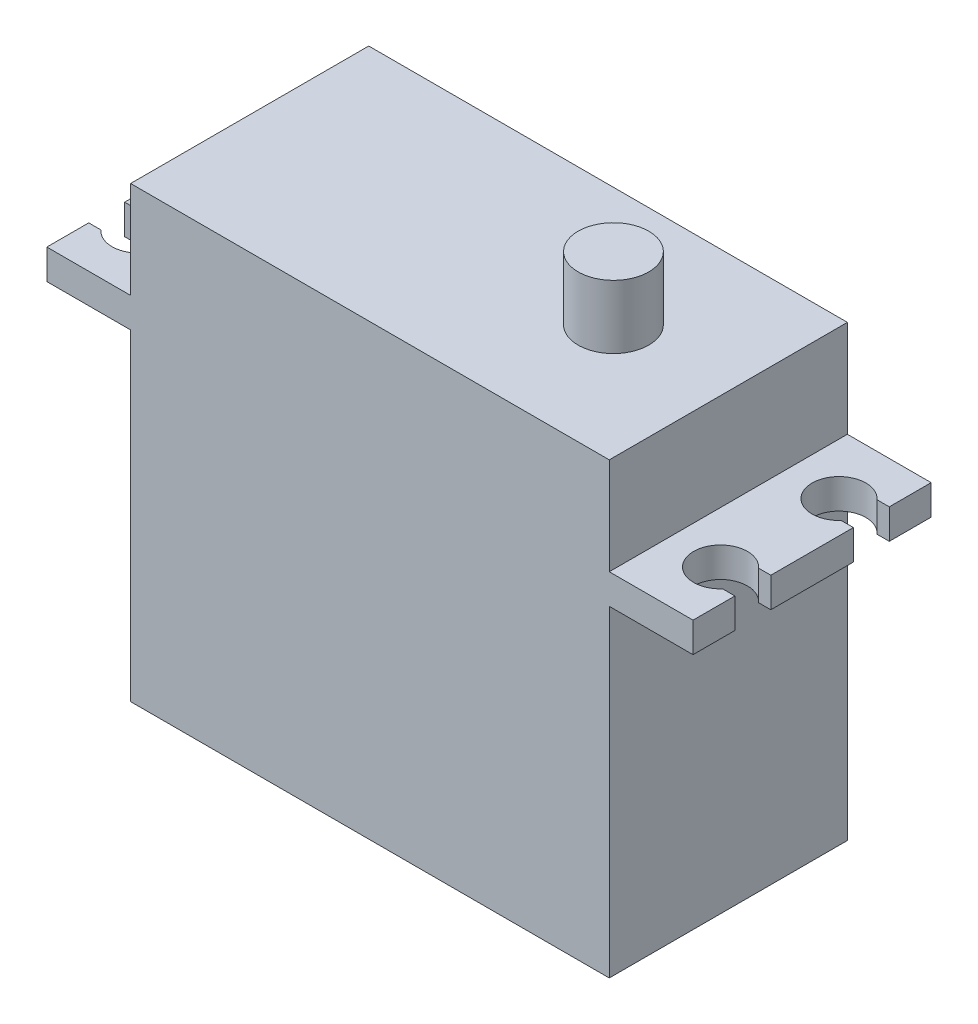
ISO-10303-21;
HEADER;
FILE_DESCRIPTION(('STEP AP214'),'2;1');
FILE_NAME('part.step','',(''),(''),'','','');
FILE_SCHEMA(('AUTOMOTIVE_DESIGN { 1 0 10303 214 1 1 1 1 }'));
ENDSEC;
DATA;
#1=APPLICATION_CONTEXT('core data for automotive mechanical design processes');
#2=APPLICATION_PROTOCOL_DEFINITION('international standard','automotive_design',2000,#1);
#3=PRODUCT_CONTEXT('',#1,'mechanical');
#4=PRODUCT('Part','Part','',(#3));
#5=PRODUCT_RELATED_PRODUCT_CATEGORY('part','',(#4));
#6=PRODUCT_DEFINITION_FORMATION('','',#4);
#7=PRODUCT_DEFINITION_CONTEXT('part definition',#1,'design');
#8=PRODUCT_DEFINITION('design','',#6,#7);
#9=PRODUCT_DEFINITION_SHAPE('','',#8);
#10=(LENGTH_UNIT() NAMED_UNIT(*) SI_UNIT(.MILLI.,.METRE.));
#11=(NAMED_UNIT(*) PLANE_ANGLE_UNIT() SI_UNIT($,.RADIAN.));
#12=(NAMED_UNIT(*) SI_UNIT($,.STERADIAN.) SOLID_ANGLE_UNIT());
#13=UNCERTAINTY_MEASURE_WITH_UNIT(LENGTH_MEASURE(1.E-05),#10,'distance_accuracy_value','');
#14=(GEOMETRIC_REPRESENTATION_CONTEXT(3) GLOBAL_UNCERTAINTY_ASSIGNED_CONTEXT((#13)) GLOBAL_UNIT_ASSIGNED_CONTEXT((#10,
#11,#12)) REPRESENTATION_CONTEXT('',''));
#15=CARTESIAN_POINT('',(0.,0.,0.));
#16=DIRECTION('',(0.,0.,1.));
#17=DIRECTION('',(1.,0.,0.));
#18=AXIS2_PLACEMENT_3D('',#15,#16,#17);
#19=CARTESIAN_POINT('',(10.4,42.8,0.));
#20=DIRECTION('',(0.,-1.,0.));
#21=DIRECTION('',(1.,0.,0.));
#22=AXIS2_PLACEMENT_3D('',#19,#20,#21);
#23=PLANE('',#22);
#24=CARTESIAN_POINT('',(10.4,42.8,0.));
#25=DIRECTION('',(0.,1.,0.));
#26=DIRECTION('',(-1.,0.,0.));
#27=AXIS2_PLACEMENT_3D('',#24,#25,#26);
#28=CIRCLE('',#27,2.95);
#29=CARTESIAN_POINT('',(7.45,42.8,0.));
#30=VERTEX_POINT('',#29);
#31=EDGE_CURVE('E11',#30,#30,#28,.T.);
#32=ORIENTED_EDGE('',*,*,#31,.T.);
#33=EDGE_LOOP('',(#32));
#34=FACE_BOUND('',#33,.T.);
#35=ADVANCED_FACE('F49',(#34),#23,.F.);
#36=CARTESIAN_POINT('',(10.4,42.8,0.));
#37=DIRECTION('',(0.,1.,0.));
#38=DIRECTION('',(-1.,0.,0.));
#39=AXIS2_PLACEMENT_3D('',#36,#37,#38);
#40=CYLINDRICAL_SURFACE('',#39,2.95);
#41=ORIENTED_EDGE('',*,*,#31,.F.);
#42=EDGE_LOOP('',(#41));
#43=FACE_BOUND('',#42,.T.);
#44=CARTESIAN_POINT('',(10.4,25.,0.));
#45=DIRECTION('',(0.,1.,0.));
#46=DIRECTION('',(-1.,0.,0.));
#47=AXIS2_PLACEMENT_3D('',#44,#45,#46);
#48=CIRCLE('',#47,2.95);
#49=CARTESIAN_POINT('',(7.45,25.,0.));
#50=VERTEX_POINT('',#49);
#51=EDGE_CURVE('E55',#50,#50,#48,.T.);
#52=ORIENTED_EDGE('',*,*,#51,.T.);
#53=EDGE_LOOP('',(#52));
#54=FACE_BOUND('',#53,.T.);
#55=ADVANCED_FACE('F81',(#43,#54),#40,.T.);
#56=CARTESIAN_POINT('',(13.35,25.,0.));
#57=DIRECTION('',(0.,-1.,0.));
#58=DIRECTION('',(1.,0.,0.));
#59=AXIS2_PLACEMENT_3D('',#56,#57,#58);
#60=PLANE('',#59);
#61=ORIENTED_EDGE('',*,*,#51,.F.);
#62=EDGE_LOOP('',(#61));
#63=FACE_BOUND('',#62,.T.);
#64=CARTESIAN_POINT('',(10.4,25.,0.));
#65=DIRECTION('',(0.,1.,0.));
#66=DIRECTION('',(-1.,0.,0.));
#67=AXIS2_PLACEMENT_3D('',#64,#65,#66);
#68=CIRCLE('',#67,6.);
#69=CARTESIAN_POINT('',(4.4,25.,0.));
#70=VERTEX_POINT('',#69);
#71=EDGE_CURVE('E59',#70,#70,#68,.T.);
#72=ORIENTED_EDGE('',*,*,#71,.T.);
#73=EDGE_LOOP('',(#72));
#74=FACE_BOUND('',#73,.T.);
#75=ADVANCED_FACE('F77',(#63,#74),#60,.F.);
#76=CARTESIAN_POINT('',(10.4,42.8,0.));
#77=DIRECTION('',(0.,1.,0.));
#78=DIRECTION('',(-1.,0.,0.));
#79=AXIS2_PLACEMENT_3D('',#76,#77,#78);
#80=CYLINDRICAL_SURFACE('',#79,6.);
#81=ORIENTED_EDGE('',*,*,#71,.F.);
#82=EDGE_LOOP('',(#81));
#83=FACE_BOUND('',#82,.T.);
#84=CARTESIAN_POINT('',(10.4,3.,0.));
#85=DIRECTION('',(0.,1.,0.));
#86=DIRECTION('',(-1.,0.,0.));
#87=AXIS2_PLACEMENT_3D('',#84,#85,#86);
#88=CIRCLE('',#87,6.);
#89=CARTESIAN_POINT('',(4.4,3.,0.));
#90=VERTEX_POINT('',#89);
#91=EDGE_CURVE('E63',#90,#90,#88,.T.);
#92=ORIENTED_EDGE('',*,*,#91,.T.);
#93=EDGE_LOOP('',(#92));
#94=FACE_BOUND('',#93,.T.);
#95=ADVANCED_FACE('F69',(#83,#94),#80,.T.);
#96=CARTESIAN_POINT('',(16.4,3.,0.));
#97=DIRECTION('',(0.,1.,0.));
#98=DIRECTION('',(-1.,0.,0.));
#99=AXIS2_PLACEMENT_3D('',#96,#97,#98);
#100=PLANE('',#99);
#101=ORIENTED_EDGE('',*,*,#91,.F.);
#102=EDGE_LOOP('',(#101));
#103=FACE_BOUND('',#102,.T.);
#104=ADVANCED_FACE('F71',(#103),#100,.F.);
#105=CLOSED_SHELL('',(#35,#55,#75,#95,#104));
#106=MANIFOLD_SOLID_BREP('B2',#105);
#107=CARTESIAN_POINT('',(-24.3,29.4,-4.95));
#108=DIRECTION('',(0.,1.,0.));
#109=DIRECTION('',(0.,0.,1.));
#110=AXIS2_PLACEMENT_3D('',#107,#108,#109);
#111=PLANE('',#110);
#112=DIRECTION('',(0.,0.,-1.));
#113=VECTOR('',#112,1.);
#114=CARTESIAN_POINT('',(20.,29.4,9.95));
#115=LINE('',#114,#113);
#116=CARTESIAN_POINT('',(20.,29.4,9.95));
#117=VERTEX_POINT('',#116);
#118=CARTESIAN_POINT('',(20.,29.4,-9.95));
#119=VERTEX_POINT('',#118);
#120=EDGE_CURVE('E135',#117,#119,#115,.T.);
#121=ORIENTED_EDGE('',*,*,#120,.F.);
#122=DIRECTION('',(1.,0.,0.));
#123=VECTOR('',#122,1.);
#124=CARTESIAN_POINT('',(-27.,29.4,9.95));
#125=LINE('',#124,#123);
#126=CARTESIAN_POINT('',(27.,29.4,9.95));
#127=VERTEX_POINT('',#126);
#128=EDGE_CURVE('E360',#117,#127,#125,.T.);
#129=ORIENTED_EDGE('',*,*,#128,.T.);
#130=DIRECTION('',(0.,0.,-1.));
#131=VECTOR('',#130,1.);
#132=CARTESIAN_POINT('',(27.,29.4,9.95));
#133=LINE('',#132,#131);
#134=CARTESIAN_POINT('',(27.,29.4,6.45));
#135=VERTEX_POINT('',#134);
#136=EDGE_CURVE('E363',#127,#135,#133,.T.);
#137=ORIENTED_EDGE('',*,*,#136,.T.);
#138=DIRECTION('',(-1.,0.,0.));
#139=VECTOR('',#138,1.);
#140=CARTESIAN_POINT('',(25.9770509831248,29.4,6.45));
#141=LINE('',#140,#139);
#142=CARTESIAN_POINT('',(25.9770509831248,29.4,6.45));
#143=VERTEX_POINT('',#142);
#144=EDGE_CURVE('E365',#135,#143,#141,.T.);
#145=ORIENTED_EDGE('',*,*,#144,.T.);
#146=CARTESIAN_POINT('',(24.3,29.4,4.95));
#147=DIRECTION('',(0.,-1.,0.));
#148=DIRECTION('',(0.,0.,1.));
#149=AXIS2_PLACEMENT_3D('',#146,#147,#148);
#150=CIRCLE('',#149,2.25);
#151=CARTESIAN_POINT('',(25.9770509831248,29.4,3.45));
#152=VERTEX_POINT('',#151);
#153=EDGE_CURVE('E367',#143,#152,#150,.T.);
#154=ORIENTED_EDGE('',*,*,#153,.T.);
#155=DIRECTION('',(1.,0.,0.));
#156=VECTOR('',#155,1.);
#157=CARTESIAN_POINT('',(25.9770509831248,29.4,3.45));
#158=LINE('',#157,#156);
#159=CARTESIAN_POINT('',(27.,29.4,3.45));
#160=VERTEX_POINT('',#159);
#161=EDGE_CURVE('E369',#152,#160,#158,.T.);
#162=ORIENTED_EDGE('',*,*,#161,.T.);
#163=DIRECTION('',(0.,0.,-1.));
#164=VECTOR('',#163,1.);
#165=CARTESIAN_POINT('',(27.,29.4,3.45));
#166=LINE('',#165,#164);
#167=CARTESIAN_POINT('',(27.,29.4,-3.45));
#168=VERTEX_POINT('',#167);
#169=EDGE_CURVE('E371',#160,#168,#166,.T.);
#170=ORIENTED_EDGE('',*,*,#169,.T.);
#171=DIRECTION('',(-1.,0.,0.));
#172=VECTOR('',#171,1.);
#173=CARTESIAN_POINT('',(25.9770509831248,29.4,-3.45));
#174=LINE('',#173,#172);
#175=CARTESIAN_POINT('',(25.9770509831248,29.4,-3.45));
#176=VERTEX_POINT('',#175);
#177=EDGE_CURVE('E373',#168,#176,#174,.T.);
#178=ORIENTED_EDGE('',*,*,#177,.T.);
#179=CARTESIAN_POINT('',(24.3,29.4,-4.95));
#180=DIRECTION('',(0.,-1.,0.));
#181=DIRECTION('',(0.,0.,1.));
#182=AXIS2_PLACEMENT_3D('',#179,#180,#181);
#183=CIRCLE('',#182,2.25);
#184=CARTESIAN_POINT('',(25.9770509831248,29.4,-6.45));
#185=VERTEX_POINT('',#184);
#186=EDGE_CURVE('E375',#176,#185,#183,.T.);
#187=ORIENTED_EDGE('',*,*,#186,.T.);
#188=DIRECTION('',(1.,0.,0.));
#189=VECTOR('',#188,1.);
#190=CARTESIAN_POINT('',(25.9770509831248,29.4,-6.45));
#191=LINE('',#190,#189);
#192=CARTESIAN_POINT('',(27.,29.4,-6.45));
#193=VERTEX_POINT('',#192);
#194=EDGE_CURVE('E377',#185,#193,#191,.T.);
#195=ORIENTED_EDGE('',*,*,#194,.T.);
#196=DIRECTION('',(0.,0.,-1.));
#197=VECTOR('',#196,1.);
#198=CARTESIAN_POINT('',(27.,29.4,-6.45));
#199=LINE('',#198,#197);
#200=CARTESIAN_POINT('',(27.,29.4,-9.95));
#201=VERTEX_POINT('',#200);
#202=EDGE_CURVE('E335',#193,#201,#199,.T.);
#203=ORIENTED_EDGE('',*,*,#202,.T.);
#204=DIRECTION('',(-1.,0.,0.));
#205=VECTOR('',#204,1.);
#206=CARTESIAN_POINT('',(-27.,29.4,-9.95));
#207=LINE('',#206,#205);
#208=EDGE_CURVE('E340',#201,#119,#207,.T.);
#209=ORIENTED_EDGE('',*,*,#208,.T.);
#210=EDGE_LOOP('',(#121,#129,#137,#145,#154,#162,#170,#178,#187,#195,#203,#209));
#211=FACE_BOUND('',#210,.T.);
#212=ADVANCED_FACE('F119',(#211),#111,.T.);
#213=CARTESIAN_POINT('',(20.,26.9,9.95));
#214=DIRECTION('',(-1.,0.,0.));
#215=DIRECTION('',(0.,0.,1.));
#216=AXIS2_PLACEMENT_3D('',#213,#214,#215);
#217=PLANE('',#216);
#218=DIRECTION('',(0.,0.,-1.));
#219=VECTOR('',#218,1.);
#220=CARTESIAN_POINT('',(20.,0.,9.95));
#221=LINE('',#220,#219);
#222=CARTESIAN_POINT('',(20.,0.,9.95));
#223=VERTEX_POINT('',#222);
#224=CARTESIAN_POINT('',(20.,0.,-9.95));
#225=VERTEX_POINT('',#224);
#226=EDGE_CURVE('E479',#223,#225,#221,.T.);
#227=ORIENTED_EDGE('',*,*,#226,.T.);
#228=DIRECTION('',(0.,-1.,0.));
#229=VECTOR('',#228,1.);
#230=CARTESIAN_POINT('',(20.,26.9,-9.95));
#231=LINE('',#230,#229);
#232=CARTESIAN_POINT('',(20.,26.9,-9.95));
#233=VERTEX_POINT('',#232);
#234=EDGE_CURVE('E47',#233,#225,#231,.T.);
#235=ORIENTED_EDGE('',*,*,#234,.F.);
#236=DIRECTION('',(0.,0.,-1.));
#237=VECTOR('',#236,1.);
#238=CARTESIAN_POINT('',(20.,26.9,9.95));
#239=LINE('',#238,#237);
#240=CARTESIAN_POINT('',(20.,26.9,9.95));
#241=VERTEX_POINT('',#240);
#242=EDGE_CURVE('E480',#241,#233,#239,.T.);
#243=ORIENTED_EDGE('',*,*,#242,.F.);
#244=DIRECTION('',(0.,-1.,0.));
#245=VECTOR('',#244,1.);
#246=CARTESIAN_POINT('',(20.,26.9,9.95));
#247=LINE('',#246,#245);
#248=EDGE_CURVE('E487',#241,#223,#247,.T.);
#249=ORIENTED_EDGE('',*,*,#248,.T.);
#250=EDGE_LOOP('',(#227,#235,#243,#249));
#251=FACE_BOUND('',#250,.T.);
#252=ADVANCED_FACE('F121',(#251),#217,.F.);
#253=CARTESIAN_POINT('',(-20.,26.9,-9.95));
#254=DIRECTION('',(0.,0.,1.));
#255=DIRECTION('',(1.,0.,0.));
#256=AXIS2_PLACEMENT_3D('',#253,#254,#255);
#257=PLANE('',#256);
#258=DIRECTION('',(-1.,0.,0.));
#259=VECTOR('',#258,1.);
#260=CARTESIAN_POINT('',(-20.,0.,-9.95));
#261=LINE('',#260,#259);
#262=CARTESIAN_POINT('',(-20.,0.,-9.95));
#263=VERTEX_POINT('',#262);
#264=EDGE_CURVE('E490',#225,#263,#261,.T.);
#265=ORIENTED_EDGE('',*,*,#264,.T.);
#266=DIRECTION('',(0.,-1.,0.));
#267=VECTOR('',#266,1.);
#268=CARTESIAN_POINT('',(-20.,26.9,-9.95));
#269=LINE('',#268,#267);
#270=CARTESIAN_POINT('',(-20.,26.9,-9.95));
#271=VERTEX_POINT('',#270);
#272=EDGE_CURVE('E128',#271,#263,#269,.T.);
#273=ORIENTED_EDGE('',*,*,#272,.F.);
#274=DIRECTION('',(-1.,0.,0.));
#275=VECTOR('',#274,1.);
#276=CARTESIAN_POINT('',(-27.,26.9,-9.95));
#277=LINE('',#276,#275);
#278=CARTESIAN_POINT('',(-27.,26.9,-9.95));
#279=VERTEX_POINT('',#278);
#280=EDGE_CURVE('E329',#271,#279,#277,.T.);
#281=ORIENTED_EDGE('',*,*,#280,.T.);
#282=DIRECTION('',(0.,-1.,0.));
#283=VECTOR('',#282,1.);
#284=CARTESIAN_POINT('',(-27.,29.4,-9.95));
#285=LINE('',#284,#283);
#286=CARTESIAN_POINT('',(-27.,29.4,-9.95));
#287=VERTEX_POINT('',#286);
#288=EDGE_CURVE('E473',#287,#279,#285,.T.);
#289=ORIENTED_EDGE('',*,*,#288,.F.);
#290=CARTESIAN_POINT('',(-20.,29.4,-9.95));
#291=VERTEX_POINT('',#290);
#292=EDGE_CURVE('E338',#291,#287,#207,.T.);
#293=ORIENTED_EDGE('',*,*,#292,.F.);
#294=DIRECTION('',(0.,-1.,0.));
#295=VECTOR('',#294,1.);
#296=CARTESIAN_POINT('',(-20.,37.5,-9.95));
#297=LINE('',#296,#295);
#298=CARTESIAN_POINT('',(-20.,37.5,-9.95));
#299=VERTEX_POINT('',#298);
#300=EDGE_CURVE('E311',#299,#291,#297,.T.);
#301=ORIENTED_EDGE('',*,*,#300,.F.);
#302=DIRECTION('',(-1.,0.,0.));
#303=VECTOR('',#302,1.);
#304=CARTESIAN_POINT('',(-20.,37.5,-9.95));
#305=LINE('',#304,#303);
#306=CARTESIAN_POINT('',(20.,37.5,-9.95));
#307=VERTEX_POINT('',#306);
#308=EDGE_CURVE('E305',#307,#299,#305,.T.);
#309=ORIENTED_EDGE('',*,*,#308,.F.);
#310=DIRECTION('',(0.,-1.,0.));
#311=VECTOR('',#310,1.);
#312=CARTESIAN_POINT('',(20.,37.5,-9.95));
#313=LINE('',#312,#311);
#314=EDGE_CURVE('E309',#307,#119,#313,.T.);
#315=ORIENTED_EDGE('',*,*,#314,.T.);
#316=ORIENTED_EDGE('',*,*,#208,.F.);
#317=DIRECTION('',(0.,-1.,0.));
#318=VECTOR('',#317,1.);
#319=CARTESIAN_POINT('',(27.,29.4,-9.95));
#320=LINE('',#319,#318);
#321=CARTESIAN_POINT('',(27.,26.9,-9.95));
#322=VERTEX_POINT('',#321);
#323=EDGE_CURVE('E476',#201,#322,#320,.T.);
#324=ORIENTED_EDGE('',*,*,#323,.T.);
#325=EDGE_CURVE('E380',#322,#233,#277,.T.);
#326=ORIENTED_EDGE('',*,*,#325,.T.);
#327=ORIENTED_EDGE('',*,*,#234,.T.);
#328=EDGE_LOOP('',(#265,#273,#281,#289,#293,#301,#309,#315,#316,#324,#326,#327));
#329=FACE_BOUND('',#328,.T.);
#330=ADVANCED_FACE('F307',(#329),#257,.F.);
#331=CARTESIAN_POINT('',(-20.,26.9,9.95));
#332=DIRECTION('',(1.,0.,0.));
#333=DIRECTION('',(0.,0.,-1.));
#334=AXIS2_PLACEMENT_3D('',#331,#332,#333);
#335=PLANE('',#334);
#336=DIRECTION('',(0.,0.,1.));
#337=VECTOR('',#336,1.);
#338=CARTESIAN_POINT('',(-20.,0.,9.95));
#339=LINE('',#338,#337);
#340=CARTESIAN_POINT('',(-20.,0.,9.95));
#341=VERTEX_POINT('',#340);
#342=EDGE_CURVE('E492',#263,#341,#339,.T.);
#343=ORIENTED_EDGE('',*,*,#342,.T.);
#344=DIRECTION('',(0.,-1.,0.));
#345=VECTOR('',#344,1.);
#346=CARTESIAN_POINT('',(-20.,26.9,9.95));
#347=LINE('',#346,#345);
#348=CARTESIAN_POINT('',(-20.,26.9,9.95));
#349=VERTEX_POINT('',#348);
#350=EDGE_CURVE('E497',#349,#341,#347,.T.);
#351=ORIENTED_EDGE('',*,*,#350,.F.);
#352=DIRECTION('',(0.,0.,1.));
#353=VECTOR('',#352,1.);
#354=CARTESIAN_POINT('',(-20.,26.9,9.95));
#355=LINE('',#354,#353);
#356=EDGE_CURVE('E483',#271,#349,#355,.T.);
#357=ORIENTED_EDGE('',*,*,#356,.F.);
#358=ORIENTED_EDGE('',*,*,#272,.T.);
#359=EDGE_LOOP('',(#343,#351,#357,#358));
#360=FACE_BOUND('',#359,.T.);
#361=ADVANCED_FACE('F504',(#360),#335,.F.);
#362=CARTESIAN_POINT('',(-20.,26.9,9.95));
#363=DIRECTION('',(0.,0.,-1.));
#364=DIRECTION('',(-1.,0.,0.));
#365=AXIS2_PLACEMENT_3D('',#362,#363,#364);
#366=PLANE('',#365);
#367=DIRECTION('',(1.,0.,0.));
#368=VECTOR('',#367,1.);
#369=CARTESIAN_POINT('',(-20.,0.,9.95));
#370=LINE('',#369,#368);
#371=EDGE_CURVE('E484',#341,#223,#370,.T.);
#372=ORIENTED_EDGE('',*,*,#371,.T.);
#373=ORIENTED_EDGE('',*,*,#248,.F.);
#374=DIRECTION('',(1.,0.,0.));
#375=VECTOR('',#374,1.);
#376=CARTESIAN_POINT('',(-27.,26.9,9.95));
#377=LINE('',#376,#375);
#378=CARTESIAN_POINT('',(27.,26.9,9.95));
#379=VERTEX_POINT('',#378);
#380=EDGE_CURVE('E401',#241,#379,#377,.T.);
#381=ORIENTED_EDGE('',*,*,#380,.T.);
#382=DIRECTION('',(0.,-1.,0.));
#383=VECTOR('',#382,1.);
#384=CARTESIAN_POINT('',(27.,29.4,9.95));
#385=LINE('',#384,#383);
#386=EDGE_CURVE('E443',#127,#379,#385,.T.);
#387=ORIENTED_EDGE('',*,*,#386,.F.);
#388=ORIENTED_EDGE('',*,*,#128,.F.);
#389=DIRECTION('',(0.,-1.,0.));
#390=VECTOR('',#389,1.);
#391=CARTESIAN_POINT('',(20.,37.5,9.95));
#392=LINE('',#391,#390);
#393=CARTESIAN_POINT('',(20.,37.5,9.95));
#394=VERTEX_POINT('',#393);
#395=EDGE_CURVE('E526',#394,#117,#392,.T.);
#396=ORIENTED_EDGE('',*,*,#395,.F.);
#397=DIRECTION('',(1.,0.,0.));
#398=VECTOR('',#397,1.);
#399=CARTESIAN_POINT('',(-20.,37.5,9.95));
#400=LINE('',#399,#398);
#401=CARTESIAN_POINT('',(-20.,37.5,9.95));
#402=VERTEX_POINT('',#401);
#403=EDGE_CURVE('E320',#402,#394,#400,.T.);
#404=ORIENTED_EDGE('',*,*,#403,.F.);
#405=DIRECTION('',(0.,-1.,0.));
#406=VECTOR('',#405,1.);
#407=CARTESIAN_POINT('',(-20.,37.5,9.95));
#408=LINE('',#407,#406);
#409=CARTESIAN_POINT('',(-20.,29.4,9.95));
#410=VERTEX_POINT('',#409);
#411=EDGE_CURVE('E331',#402,#410,#408,.T.);
#412=ORIENTED_EDGE('',*,*,#411,.T.);
#413=CARTESIAN_POINT('',(-27.,29.4,9.95));
#414=VERTEX_POINT('',#413);
#415=EDGE_CURVE('E361',#414,#410,#125,.T.);
#416=ORIENTED_EDGE('',*,*,#415,.F.);
#417=DIRECTION('',(0.,-1.,0.));
#418=VECTOR('',#417,1.);
#419=CARTESIAN_POINT('',(-27.,29.4,9.95));
#420=LINE('',#419,#418);
#421=CARTESIAN_POINT('',(-27.,26.9,9.95));
#422=VERTEX_POINT('',#421);
#423=EDGE_CURVE('E446',#414,#422,#420,.T.);
#424=ORIENTED_EDGE('',*,*,#423,.T.);
#425=EDGE_CURVE('E402',#422,#349,#377,.T.);
#426=ORIENTED_EDGE('',*,*,#425,.T.);
#427=ORIENTED_EDGE('',*,*,#350,.T.);
#428=EDGE_LOOP('',(#372,#373,#381,#387,#388,#396,#404,#412,#416,#424,#426,#427));
#429=FACE_BOUND('',#428,.T.);
#430=ADVANCED_FACE('F511',(#429),#366,.F.);
#431=CARTESIAN_POINT('',(0.,0.,0.));
#432=DIRECTION('',(0.,-1.,0.));
#433=DIRECTION('',(0.,0.,-1.));
#434=AXIS2_PLACEMENT_3D('',#431,#432,#433);
#435=PLANE('',#434);
#436=ORIENTED_EDGE('',*,*,#226,.F.);
#437=ORIENTED_EDGE('',*,*,#371,.F.);
#438=ORIENTED_EDGE('',*,*,#342,.F.);
#439=ORIENTED_EDGE('',*,*,#264,.F.);
#440=EDGE_LOOP('',(#436,#437,#438,#439));
#441=FACE_BOUND('',#440,.T.);
#442=ADVANCED_FACE('F509',(#441),#435,.T.);
#443=CARTESIAN_POINT('',(-24.3,26.9,-4.95));
#444=DIRECTION('',(0.,1.,0.));
#445=DIRECTION('',(0.,0.,1.));
#446=AXIS2_PLACEMENT_3D('',#443,#444,#445);
#447=PLANE('',#446);
#448=ORIENTED_EDGE('',*,*,#380,.F.);
#449=ORIENTED_EDGE('',*,*,#242,.T.);
#450=ORIENTED_EDGE('',*,*,#325,.F.);
#451=DIRECTION('',(0.,0.,-1.));
#452=VECTOR('',#451,1.);
#453=CARTESIAN_POINT('',(27.,26.9,-6.45));
#454=LINE('',#453,#452);
#455=CARTESIAN_POINT('',(27.,26.9,-6.45));
#456=VERTEX_POINT('',#455);
#457=EDGE_CURVE('E326',#456,#322,#454,.T.);
#458=ORIENTED_EDGE('',*,*,#457,.F.);
#459=DIRECTION('',(1.,0.,0.));
#460=VECTOR('',#459,1.);
#461=CARTESIAN_POINT('',(25.9770509831248,26.9,-6.45));
#462=LINE('',#461,#460);
#463=CARTESIAN_POINT('',(25.9770509831248,26.9,-6.45));
#464=VERTEX_POINT('',#463);
#465=EDGE_CURVE('E339',#464,#456,#462,.T.);
#466=ORIENTED_EDGE('',*,*,#465,.F.);
#467=CARTESIAN_POINT('',(24.3,26.9,-4.95));
#468=DIRECTION('',(0.,-1.,0.));
#469=DIRECTION('',(0.,0.,1.));
#470=AXIS2_PLACEMENT_3D('',#467,#468,#469);
#471=CIRCLE('',#470,2.25);
#472=CARTESIAN_POINT('',(25.9770509831248,26.9,-3.45));
#473=VERTEX_POINT('',#472);
#474=EDGE_CURVE('E417',#473,#464,#471,.T.);
#475=ORIENTED_EDGE('',*,*,#474,.F.);
#476=DIRECTION('',(-1.,0.,0.));
#477=VECTOR('',#476,1.);
#478=CARTESIAN_POINT('',(25.9770509831248,26.9,-3.45));
#479=LINE('',#478,#477);
#480=CARTESIAN_POINT('',(27.,26.9,-3.45));
#481=VERTEX_POINT('',#480);
#482=EDGE_CURVE('E415',#481,#473,#479,.T.);
#483=ORIENTED_EDGE('',*,*,#482,.F.);
#484=DIRECTION('',(0.,0.,-1.));
#485=VECTOR('',#484,1.);
#486=CARTESIAN_POINT('',(27.,26.9,3.45));
#487=LINE('',#486,#485);
#488=CARTESIAN_POINT('',(27.,26.9,3.45));
#489=VERTEX_POINT('',#488);
#490=EDGE_CURVE('E413',#489,#481,#487,.T.);
#491=ORIENTED_EDGE('',*,*,#490,.F.);
#492=DIRECTION('',(1.,0.,0.));
#493=VECTOR('',#492,1.);
#494=CARTESIAN_POINT('',(25.9770509831248,26.9,3.45));
#495=LINE('',#494,#493);
#496=CARTESIAN_POINT('',(25.9770509831248,26.9,3.45));
#497=VERTEX_POINT('',#496);
#498=EDGE_CURVE('E411',#497,#489,#495,.T.);
#499=ORIENTED_EDGE('',*,*,#498,.F.);
#500=CARTESIAN_POINT('',(24.3,26.9,4.95));
#501=DIRECTION('',(0.,-1.,0.));
#502=DIRECTION('',(0.,0.,1.));
#503=AXIS2_PLACEMENT_3D('',#500,#501,#502);
#504=CIRCLE('',#503,2.25);
#505=CARTESIAN_POINT('',(25.9770509831248,26.9,6.45));
#506=VERTEX_POINT('',#505);
#507=EDGE_CURVE('E409',#506,#497,#504,.T.);
#508=ORIENTED_EDGE('',*,*,#507,.F.);
#509=DIRECTION('',(-1.,0.,0.));
#510=VECTOR('',#509,1.);
#511=CARTESIAN_POINT('',(25.9770509831248,26.9,6.45));
#512=LINE('',#511,#510);
#513=CARTESIAN_POINT('',(27.,26.9,6.45));
#514=VERTEX_POINT('',#513);
#515=EDGE_CURVE('E407',#514,#506,#512,.T.);
#516=ORIENTED_EDGE('',*,*,#515,.F.);
#517=DIRECTION('',(0.,0.,-1.));
#518=VECTOR('',#517,1.);
#519=CARTESIAN_POINT('',(27.,26.9,9.95));
#520=LINE('',#519,#518);
#521=EDGE_CURVE('E405',#379,#514,#520,.T.);
#522=ORIENTED_EDGE('',*,*,#521,.F.);
#523=EDGE_LOOP('',(#448,#449,#450,#458,#466,#475,#483,#491,#499,#508,#516,#522));
#524=FACE_BOUND('',#523,.T.);
#525=ADVANCED_FACE('F517',(#524),#447,.F.);
#526=ORIENTED_EDGE('',*,*,#280,.F.);
#527=ORIENTED_EDGE('',*,*,#356,.T.);
#528=ORIENTED_EDGE('',*,*,#425,.F.);
#529=DIRECTION('',(0.,0.,1.));
#530=VECTOR('',#529,1.);
#531=CARTESIAN_POINT('',(-27.,26.9,9.95));
#532=LINE('',#531,#530);
#533=CARTESIAN_POINT('',(-27.,26.9,6.45));
#534=VERTEX_POINT('',#533);
#535=EDGE_CURVE('E399',#534,#422,#532,.T.);
#536=ORIENTED_EDGE('',*,*,#535,.F.);
#537=DIRECTION('',(-1.,0.,0.));
#538=VECTOR('',#537,1.);
#539=CARTESIAN_POINT('',(-25.9770509831249,26.9,6.45));
#540=LINE('',#539,#538);
#541=CARTESIAN_POINT('',(-25.9770509831249,26.9,6.45));
#542=VERTEX_POINT('',#541);
#543=EDGE_CURVE('E397',#542,#534,#540,.T.);
#544=ORIENTED_EDGE('',*,*,#543,.F.);
#545=CARTESIAN_POINT('',(-24.3,26.9,4.95));
#546=DIRECTION('',(0.,-1.,0.));
#547=DIRECTION('',(0.,0.,1.));
#548=AXIS2_PLACEMENT_3D('',#545,#546,#547);
#549=CIRCLE('',#548,2.25);
#550=CARTESIAN_POINT('',(-25.9770509831249,26.9,3.45));
#551=VERTEX_POINT('',#550);
#552=EDGE_CURVE('E395',#551,#542,#549,.T.);
#553=ORIENTED_EDGE('',*,*,#552,.F.);
#554=DIRECTION('',(1.,0.,0.));
#555=VECTOR('',#554,1.);
#556=CARTESIAN_POINT('',(-25.9770509831249,26.9,3.45));
#557=LINE('',#556,#555);
#558=CARTESIAN_POINT('',(-27.,26.9,3.45));
#559=VERTEX_POINT('',#558);
#560=EDGE_CURVE('E393',#559,#551,#557,.T.);
#561=ORIENTED_EDGE('',*,*,#560,.F.);
#562=DIRECTION('',(0.,0.,1.));
#563=VECTOR('',#562,1.);
#564=CARTESIAN_POINT('',(-27.,26.9,3.45));
#565=LINE('',#564,#563);
#566=CARTESIAN_POINT('',(-27.,26.9,-3.45000000000001));
#567=VERTEX_POINT('',#566);
#568=EDGE_CURVE('E391',#567,#559,#565,.T.);
#569=ORIENTED_EDGE('',*,*,#568,.F.);
#570=DIRECTION('',(-1.,0.,0.));
#571=VECTOR('',#570,1.);
#572=CARTESIAN_POINT('',(-25.9770509831249,26.9,-3.45000000000001));
#573=LINE('',#572,#571);
#574=CARTESIAN_POINT('',(-25.9770509831249,26.9,-3.45000000000001));
#575=VERTEX_POINT('',#574);
#576=EDGE_CURVE('E389',#575,#567,#573,.T.);
#577=ORIENTED_EDGE('',*,*,#576,.F.);
#578=CARTESIAN_POINT('',(-24.3,26.9,-4.95));
#579=DIRECTION('',(0.,-1.,0.));
#580=DIRECTION('',(0.,0.,1.));
#581=AXIS2_PLACEMENT_3D('',#578,#579,#580);
#582=CIRCLE('',#581,2.25);
#583=CARTESIAN_POINT('',(-25.9770509831249,26.9,-6.45));
#584=VERTEX_POINT('',#583);
#585=EDGE_CURVE('E387',#584,#575,#582,.T.);
#586=ORIENTED_EDGE('',*,*,#585,.F.);
#587=DIRECTION('',(1.,0.,0.));
#588=VECTOR('',#587,1.);
#589=CARTESIAN_POINT('',(-25.9770509831249,26.9,-6.45));
#590=LINE('',#589,#588);
#591=CARTESIAN_POINT('',(-27.,26.9,-6.45));
#592=VERTEX_POINT('',#591);
#593=EDGE_CURVE('E385',#592,#584,#590,.T.);
#594=ORIENTED_EDGE('',*,*,#593,.F.);
#595=DIRECTION('',(0.,0.,1.));
#596=VECTOR('',#595,1.);
#597=CARTESIAN_POINT('',(-27.,26.9,-6.45));
#598=LINE('',#597,#596);
#599=EDGE_CURVE('E383',#279,#592,#598,.T.);
#600=ORIENTED_EDGE('',*,*,#599,.F.);
#601=EDGE_LOOP('',(#526,#527,#528,#536,#544,#553,#561,#569,#577,#586,#594,#600));
#602=FACE_BOUND('',#601,.T.);
#603=ADVANCED_FACE('F644',(#602),#447,.F.);
#604=CARTESIAN_POINT('',(27.,29.4,-6.45));
#605=DIRECTION('',(-1.,0.,0.));
#606=DIRECTION('',(0.,0.,1.));
#607=AXIS2_PLACEMENT_3D('',#604,#605,#606);
#608=PLANE('',#607);
#609=ORIENTED_EDGE('',*,*,#457,.T.);
#610=ORIENTED_EDGE('',*,*,#323,.F.);
#611=ORIENTED_EDGE('',*,*,#202,.F.);
#612=DIRECTION('',(0.,-1.,0.));
#613=VECTOR('',#612,1.);
#614=CARTESIAN_POINT('',(27.,29.4,-6.45));
#615=LINE('',#614,#613);
#616=EDGE_CURVE('E378',#193,#456,#615,.T.);
#617=ORIENTED_EDGE('',*,*,#616,.T.);
#618=EDGE_LOOP('',(#609,#610,#611,#617));
#619=FACE_BOUND('',#618,.T.);
#620=ADVANCED_FACE('F640',(#619),#608,.F.);
#621=CARTESIAN_POINT('',(-27.,29.4,-6.45));
#622=DIRECTION('',(1.,0.,0.));
#623=DIRECTION('',(0.,0.,-1.));
#624=AXIS2_PLACEMENT_3D('',#621,#622,#623);
#625=PLANE('',#624);
#626=ORIENTED_EDGE('',*,*,#599,.T.);
#627=DIRECTION('',(0.,-1.,0.));
#628=VECTOR('',#627,1.);
#629=CARTESIAN_POINT('',(-27.,29.4,-6.45));
#630=LINE('',#629,#628);
#631=CARTESIAN_POINT('',(-27.,29.4,-6.45));
#632=VERTEX_POINT('',#631);
#633=EDGE_CURVE('E470',#632,#592,#630,.T.);
#634=ORIENTED_EDGE('',*,*,#633,.F.);
#635=DIRECTION('',(0.,0.,1.));
#636=VECTOR('',#635,1.);
#637=CARTESIAN_POINT('',(-27.,29.4,-6.45));
#638=LINE('',#637,#636);
#639=EDGE_CURVE('E342',#287,#632,#638,.T.);
#640=ORIENTED_EDGE('',*,*,#639,.F.);
#641=ORIENTED_EDGE('',*,*,#288,.T.);
#642=EDGE_LOOP('',(#626,#634,#640,#641));
#643=FACE_BOUND('',#642,.T.);
#644=ADVANCED_FACE('F636',(#643),#625,.F.);
#645=CARTESIAN_POINT('',(-25.9770509831249,29.4,-6.45));
#646=DIRECTION('',(0.,0.,-1.));
#647=DIRECTION('',(-1.,0.,0.));
#648=AXIS2_PLACEMENT_3D('',#645,#646,#647);
#649=PLANE('',#648);
#650=ORIENTED_EDGE('',*,*,#593,.T.);
#651=DIRECTION('',(0.,-1.,0.));
#652=VECTOR('',#651,1.);
#653=CARTESIAN_POINT('',(-25.9770509831249,29.4,-6.45));
#654=LINE('',#653,#652);
#655=CARTESIAN_POINT('',(-25.9770509831249,29.4,-6.45));
#656=VERTEX_POINT('',#655);
#657=EDGE_CURVE('E467',#656,#584,#654,.T.);
#658=ORIENTED_EDGE('',*,*,#657,.F.);
#659=DIRECTION('',(1.,0.,0.));
#660=VECTOR('',#659,1.);
#661=CARTESIAN_POINT('',(-25.9770509831249,29.4,-6.45));
#662=LINE('',#661,#660);
#663=EDGE_CURVE('E344',#632,#656,#662,.T.);
#664=ORIENTED_EDGE('',*,*,#663,.F.);
#665=ORIENTED_EDGE('',*,*,#633,.T.);
#666=EDGE_LOOP('',(#650,#658,#664,#665));
#667=FACE_BOUND('',#666,.T.);
#668=ADVANCED_FACE('F632',(#667),#649,.F.);
#669=CARTESIAN_POINT('',(-24.3,29.4,-4.95));
#670=DIRECTION('',(0.,-1.,0.));
#671=DIRECTION('',(0.,0.,-1.));
#672=AXIS2_PLACEMENT_3D('',#669,#670,#671);
#673=CYLINDRICAL_SURFACE('',#672,2.25);
#674=ORIENTED_EDGE('',*,*,#585,.T.);
#675=DIRECTION('',(0.,-1.,0.));
#676=VECTOR('',#675,1.);
#677=CARTESIAN_POINT('',(-25.9770509831249,29.4,-3.45000000000001));
#678=LINE('',#677,#676);
#679=CARTESIAN_POINT('',(-25.9770509831249,29.4,-3.45000000000001));
#680=VERTEX_POINT('',#679);
#681=EDGE_CURVE('E464',#680,#575,#678,.T.);
#682=ORIENTED_EDGE('',*,*,#681,.F.);
#683=CARTESIAN_POINT('',(-24.3,29.4,-4.95));
#684=DIRECTION('',(0.,-1.,0.));
#685=DIRECTION('',(0.,0.,1.));
#686=AXIS2_PLACEMENT_3D('',#683,#684,#685);
#687=CIRCLE('',#686,2.25);
#688=EDGE_CURVE('E346',#656,#680,#687,.T.);
#689=ORIENTED_EDGE('',*,*,#688,.F.);
#690=ORIENTED_EDGE('',*,*,#657,.T.);
#691=EDGE_LOOP('',(#674,#682,#689,#690));
#692=FACE_BOUND('',#691,.T.);
#693=ADVANCED_FACE('F628',(#692),#673,.F.);
#694=CARTESIAN_POINT('',(-25.9770509831249,29.4,-3.45000000000001));
#695=DIRECTION('',(0.,0.,1.));
#696=DIRECTION('',(1.,0.,0.));
#697=AXIS2_PLACEMENT_3D('',#694,#695,#696);
#698=PLANE('',#697);
#699=ORIENTED_EDGE('',*,*,#576,.T.);
#700=DIRECTION('',(0.,-1.,0.));
#701=VECTOR('',#700,1.);
#702=CARTESIAN_POINT('',(-27.,29.4,-3.45000000000001));
#703=LINE('',#702,#701);
#704=CARTESIAN_POINT('',(-27.,29.4,-3.45000000000001));
#705=VERTEX_POINT('',#704);
#706=EDGE_CURVE('E461',#705,#567,#703,.T.);
#707=ORIENTED_EDGE('',*,*,#706,.F.);
#708=DIRECTION('',(-1.,0.,0.));
#709=VECTOR('',#708,1.);
#710=CARTESIAN_POINT('',(-25.9770509831249,29.4,-3.45000000000001));
#711=LINE('',#710,#709);
#712=EDGE_CURVE('E348',#680,#705,#711,.T.);
#713=ORIENTED_EDGE('',*,*,#712,.F.);
#714=ORIENTED_EDGE('',*,*,#681,.T.);
#715=EDGE_LOOP('',(#699,#707,#713,#714));
#716=FACE_BOUND('',#715,.T.);
#717=ADVANCED_FACE('F624',(#716),#698,.F.);
#718=CARTESIAN_POINT('',(-27.,29.4,3.45));
#719=DIRECTION('',(1.,0.,0.));
#720=DIRECTION('',(0.,0.,-1.));
#721=AXIS2_PLACEMENT_3D('',#718,#719,#720);
#722=PLANE('',#721);
#723=ORIENTED_EDGE('',*,*,#568,.T.);
#724=DIRECTION('',(0.,-1.,0.));
#725=VECTOR('',#724,1.);
#726=CARTESIAN_POINT('',(-27.,29.4,3.45));
#727=LINE('',#726,#725);
#728=CARTESIAN_POINT('',(-27.,29.4,3.45));
#729=VERTEX_POINT('',#728);
#730=EDGE_CURVE('E458',#729,#559,#727,.T.);
#731=ORIENTED_EDGE('',*,*,#730,.F.);
#732=DIRECTION('',(0.,0.,1.));
#733=VECTOR('',#732,1.);
#734=CARTESIAN_POINT('',(-27.,29.4,3.45));
#735=LINE('',#734,#733);
#736=EDGE_CURVE('E350',#705,#729,#735,.T.);
#737=ORIENTED_EDGE('',*,*,#736,.F.);
#738=ORIENTED_EDGE('',*,*,#706,.T.);
#739=EDGE_LOOP('',(#723,#731,#737,#738));
#740=FACE_BOUND('',#739,.T.);
#741=ADVANCED_FACE('F620',(#740),#722,.F.);
#742=CARTESIAN_POINT('',(-25.9770509831249,29.4,3.45));
#743=DIRECTION('',(0.,0.,-1.));
#744=DIRECTION('',(-1.,0.,0.));
#745=AXIS2_PLACEMENT_3D('',#742,#743,#744);
#746=PLANE('',#745);
#747=ORIENTED_EDGE('',*,*,#560,.T.);
#748=DIRECTION('',(0.,-1.,0.));
#749=VECTOR('',#748,1.);
#750=CARTESIAN_POINT('',(-25.9770509831249,29.4,3.45));
#751=LINE('',#750,#749);
#752=CARTESIAN_POINT('',(-25.9770509831249,29.4,3.45));
#753=VERTEX_POINT('',#752);
#754=EDGE_CURVE('E455',#753,#551,#751,.T.);
#755=ORIENTED_EDGE('',*,*,#754,.F.);
#756=DIRECTION('',(1.,0.,0.));
#757=VECTOR('',#756,1.);
#758=CARTESIAN_POINT('',(-25.9770509831249,29.4,3.45));
#759=LINE('',#758,#757);
#760=EDGE_CURVE('E352',#729,#753,#759,.T.);
#761=ORIENTED_EDGE('',*,*,#760,.F.);
#762=ORIENTED_EDGE('',*,*,#730,.T.);
#763=EDGE_LOOP('',(#747,#755,#761,#762));
#764=FACE_BOUND('',#763,.T.);
#765=ADVANCED_FACE('F616',(#764),#746,.F.);
#766=CARTESIAN_POINT('',(-24.3,29.4,4.95));
#767=DIRECTION('',(0.,-1.,0.));
#768=DIRECTION('',(0.,0.,-1.));
#769=AXIS2_PLACEMENT_3D('',#766,#767,#768);
#770=CYLINDRICAL_SURFACE('',#769,2.25);
#771=ORIENTED_EDGE('',*,*,#552,.T.);
#772=DIRECTION('',(0.,-1.,0.));
#773=VECTOR('',#772,1.);
#774=CARTESIAN_POINT('',(-25.9770509831249,29.4,6.45));
#775=LINE('',#774,#773);
#776=CARTESIAN_POINT('',(-25.9770509831249,29.4,6.45));
#777=VERTEX_POINT('',#776);
#778=EDGE_CURVE('E452',#777,#542,#775,.T.);
#779=ORIENTED_EDGE('',*,*,#778,.F.);
#780=CARTESIAN_POINT('',(-24.3,29.4,4.95));
#781=DIRECTION('',(0.,-1.,0.));
#782=DIRECTION('',(0.,0.,1.));
#783=AXIS2_PLACEMENT_3D('',#780,#781,#782);
#784=CIRCLE('',#783,2.25);
#785=EDGE_CURVE('E354',#753,#777,#784,.T.);
#786=ORIENTED_EDGE('',*,*,#785,.F.);
#787=ORIENTED_EDGE('',*,*,#754,.T.);
#788=EDGE_LOOP('',(#771,#779,#786,#787));
#789=FACE_BOUND('',#788,.T.);
#790=ADVANCED_FACE('F612',(#789),#770,.F.);
#791=CARTESIAN_POINT('',(-25.9770509831249,29.4,6.45));
#792=DIRECTION('',(0.,0.,1.));
#793=DIRECTION('',(1.,0.,0.));
#794=AXIS2_PLACEMENT_3D('',#791,#792,#793);
#795=PLANE('',#794);
#796=ORIENTED_EDGE('',*,*,#543,.T.);
#797=DIRECTION('',(0.,-1.,0.));
#798=VECTOR('',#797,1.);
#799=CARTESIAN_POINT('',(-27.,29.4,6.45));
#800=LINE('',#799,#798);
#801=CARTESIAN_POINT('',(-27.,29.4,6.45));
#802=VERTEX_POINT('',#801);
#803=EDGE_CURVE('E449',#802,#534,#800,.T.);
#804=ORIENTED_EDGE('',*,*,#803,.F.);
#805=DIRECTION('',(-1.,0.,0.));
#806=VECTOR('',#805,1.);
#807=CARTESIAN_POINT('',(-25.9770509831249,29.4,6.45));
#808=LINE('',#807,#806);
#809=EDGE_CURVE('E356',#777,#802,#808,.T.);
#810=ORIENTED_EDGE('',*,*,#809,.F.);
#811=ORIENTED_EDGE('',*,*,#778,.T.);
#812=EDGE_LOOP('',(#796,#804,#810,#811));
#813=FACE_BOUND('',#812,.T.);
#814=ADVANCED_FACE('F608',(#813),#795,.F.);
#815=CARTESIAN_POINT('',(-27.,29.4,9.95));
#816=DIRECTION('',(1.,0.,0.));
#817=DIRECTION('',(0.,0.,-1.));
#818=AXIS2_PLACEMENT_3D('',#815,#816,#817);
#819=PLANE('',#818);
#820=ORIENTED_EDGE('',*,*,#535,.T.);
#821=ORIENTED_EDGE('',*,*,#423,.F.);
#822=DIRECTION('',(0.,0.,1.));
#823=VECTOR('',#822,1.);
#824=CARTESIAN_POINT('',(-27.,29.4,9.95));
#825=LINE('',#824,#823);
#826=EDGE_CURVE('E358',#802,#414,#825,.T.);
#827=ORIENTED_EDGE('',*,*,#826,.F.);
#828=ORIENTED_EDGE('',*,*,#803,.T.);
#829=EDGE_LOOP('',(#820,#821,#827,#828));
#830=FACE_BOUND('',#829,.T.);
#831=ADVANCED_FACE('F605',(#830),#819,.F.);
#832=CARTESIAN_POINT('',(27.,29.4,9.95));
#833=DIRECTION('',(-1.,0.,0.));
#834=DIRECTION('',(0.,0.,1.));
#835=AXIS2_PLACEMENT_3D('',#832,#833,#834);
#836=PLANE('',#835);
#837=ORIENTED_EDGE('',*,*,#521,.T.);
#838=DIRECTION('',(0.,-1.,0.));
#839=VECTOR('',#838,1.);
#840=CARTESIAN_POINT('',(27.,29.4,6.45));
#841=LINE('',#840,#839);
#842=EDGE_CURVE('E440',#135,#514,#841,.T.);
#843=ORIENTED_EDGE('',*,*,#842,.F.);
#844=ORIENTED_EDGE('',*,*,#136,.F.);
#845=ORIENTED_EDGE('',*,*,#386,.T.);
#846=EDGE_LOOP('',(#837,#843,#844,#845));
#847=FACE_BOUND('',#846,.T.);
#848=ADVANCED_FACE('F522',(#847),#836,.F.);
#849=CARTESIAN_POINT('',(25.9770509831248,29.4,6.45));
#850=DIRECTION('',(0.,0.,1.));
#851=DIRECTION('',(1.,0.,0.));
#852=AXIS2_PLACEMENT_3D('',#849,#850,#851);
#853=PLANE('',#852);
#854=ORIENTED_EDGE('',*,*,#515,.T.);
#855=DIRECTION('',(0.,-1.,0.));
#856=VECTOR('',#855,1.);
#857=CARTESIAN_POINT('',(25.9770509831248,29.4,6.45));
#858=LINE('',#857,#856);
#859=EDGE_CURVE('E437',#143,#506,#858,.T.);
#860=ORIENTED_EDGE('',*,*,#859,.F.);
#861=ORIENTED_EDGE('',*,*,#144,.F.);
#862=ORIENTED_EDGE('',*,*,#842,.T.);
#863=EDGE_LOOP('',(#854,#860,#861,#862));
#864=FACE_BOUND('',#863,.T.);
#865=ADVANCED_FACE('F598',(#864),#853,.F.);
#866=CARTESIAN_POINT('',(24.3,29.4,4.95));
#867=DIRECTION('',(0.,-1.,0.));
#868=DIRECTION('',(0.,0.,-1.));
#869=AXIS2_PLACEMENT_3D('',#866,#867,#868);
#870=CYLINDRICAL_SURFACE('',#869,2.25);
#871=ORIENTED_EDGE('',*,*,#507,.T.);
#872=DIRECTION('',(0.,-1.,0.));
#873=VECTOR('',#872,1.);
#874=CARTESIAN_POINT('',(25.9770509831248,29.4,3.45));
#875=LINE('',#874,#873);
#876=EDGE_CURVE('E434',#152,#497,#875,.T.);
#877=ORIENTED_EDGE('',*,*,#876,.F.);
#878=ORIENTED_EDGE('',*,*,#153,.F.);
#879=ORIENTED_EDGE('',*,*,#859,.T.);
#880=EDGE_LOOP('',(#871,#877,#878,#879));
#881=FACE_BOUND('',#880,.T.);
#882=ADVANCED_FACE('F594',(#881),#870,.F.);
#883=CARTESIAN_POINT('',(25.9770509831248,29.4,3.45));
#884=DIRECTION('',(0.,0.,-1.));
#885=DIRECTION('',(-1.,0.,0.));
#886=AXIS2_PLACEMENT_3D('',#883,#884,#885);
#887=PLANE('',#886);
#888=ORIENTED_EDGE('',*,*,#498,.T.);
#889=DIRECTION('',(0.,-1.,0.));
#890=VECTOR('',#889,1.);
#891=CARTESIAN_POINT('',(27.,29.4,3.45));
#892=LINE('',#891,#890);
#893=EDGE_CURVE('E431',#160,#489,#892,.T.);
#894=ORIENTED_EDGE('',*,*,#893,.F.);
#895=ORIENTED_EDGE('',*,*,#161,.F.);
#896=ORIENTED_EDGE('',*,*,#876,.T.);
#897=EDGE_LOOP('',(#888,#894,#895,#896));
#898=FACE_BOUND('',#897,.T.);
#899=ADVANCED_FACE('F590',(#898),#887,.F.);
#900=CARTESIAN_POINT('',(27.,29.4,3.45));
#901=DIRECTION('',(-1.,0.,0.));
#902=DIRECTION('',(0.,0.,1.));
#903=AXIS2_PLACEMENT_3D('',#900,#901,#902);
#904=PLANE('',#903);
#905=ORIENTED_EDGE('',*,*,#490,.T.);
#906=DIRECTION('',(0.,-1.,0.));
#907=VECTOR('',#906,1.);
#908=CARTESIAN_POINT('',(27.,29.4,-3.45));
#909=LINE('',#908,#907);
#910=EDGE_CURVE('E428',#168,#481,#909,.T.);
#911=ORIENTED_EDGE('',*,*,#910,.F.);
#912=ORIENTED_EDGE('',*,*,#169,.F.);
#913=ORIENTED_EDGE('',*,*,#893,.T.);
#914=EDGE_LOOP('',(#905,#911,#912,#913));
#915=FACE_BOUND('',#914,.T.);
#916=ADVANCED_FACE('F586',(#915),#904,.F.);
#917=CARTESIAN_POINT('',(25.9770509831248,29.4,-3.45));
#918=DIRECTION('',(0.,0.,1.));
#919=DIRECTION('',(1.,0.,0.));
#920=AXIS2_PLACEMENT_3D('',#917,#918,#919);
#921=PLANE('',#920);
#922=ORIENTED_EDGE('',*,*,#482,.T.);
#923=DIRECTION('',(0.,-1.,0.));
#924=VECTOR('',#923,1.);
#925=CARTESIAN_POINT('',(25.9770509831248,29.4,-3.45));
#926=LINE('',#925,#924);
#927=EDGE_CURVE('E425',#176,#473,#926,.T.);
#928=ORIENTED_EDGE('',*,*,#927,.F.);
#929=ORIENTED_EDGE('',*,*,#177,.F.);
#930=ORIENTED_EDGE('',*,*,#910,.T.);
#931=EDGE_LOOP('',(#922,#928,#929,#930));
#932=FACE_BOUND('',#931,.T.);
#933=ADVANCED_FACE('F580',(#932),#921,.F.);
#934=CARTESIAN_POINT('',(24.3,29.4,-4.95));
#935=DIRECTION('',(0.,-1.,0.));
#936=DIRECTION('',(0.,0.,-1.));
#937=AXIS2_PLACEMENT_3D('',#934,#935,#936);
#938=CYLINDRICAL_SURFACE('',#937,2.25);
#939=ORIENTED_EDGE('',*,*,#474,.T.);
#940=DIRECTION('',(0.,-1.,0.));
#941=VECTOR('',#940,1.);
#942=CARTESIAN_POINT('',(25.9770509831248,29.4,-6.45));
#943=LINE('',#942,#941);
#944=EDGE_CURVE('E422',#185,#464,#943,.T.);
#945=ORIENTED_EDGE('',*,*,#944,.F.);
#946=ORIENTED_EDGE('',*,*,#186,.F.);
#947=ORIENTED_EDGE('',*,*,#927,.T.);
#948=EDGE_LOOP('',(#939,#945,#946,#947));
#949=FACE_BOUND('',#948,.T.);
#950=ADVANCED_FACE('F574',(#949),#938,.F.);
#951=CARTESIAN_POINT('',(25.9770509831248,29.4,-6.45));
#952=DIRECTION('',(0.,0.,-1.));
#953=DIRECTION('',(-1.,0.,0.));
#954=AXIS2_PLACEMENT_3D('',#951,#952,#953);
#955=PLANE('',#954);
#956=ORIENTED_EDGE('',*,*,#465,.T.);
#957=ORIENTED_EDGE('',*,*,#616,.F.);
#958=ORIENTED_EDGE('',*,*,#194,.F.);
#959=ORIENTED_EDGE('',*,*,#944,.T.);
#960=EDGE_LOOP('',(#956,#957,#958,#959));
#961=FACE_BOUND('',#960,.T.);
#962=ADVANCED_FACE('F568',(#961),#955,.F.);
#963=DIRECTION('',(0.,0.,1.));
#964=VECTOR('',#963,1.);
#965=CARTESIAN_POINT('',(-20.,29.4,9.95));
#966=LINE('',#965,#964);
#967=EDGE_CURVE('E143',#291,#410,#966,.T.);
#968=ORIENTED_EDGE('',*,*,#967,.F.);
#969=ORIENTED_EDGE('',*,*,#292,.T.);
#970=ORIENTED_EDGE('',*,*,#639,.T.);
#971=ORIENTED_EDGE('',*,*,#663,.T.);
#972=ORIENTED_EDGE('',*,*,#688,.T.);
#973=ORIENTED_EDGE('',*,*,#712,.T.);
#974=ORIENTED_EDGE('',*,*,#736,.T.);
#975=ORIENTED_EDGE('',*,*,#760,.T.);
#976=ORIENTED_EDGE('',*,*,#785,.T.);
#977=ORIENTED_EDGE('',*,*,#809,.T.);
#978=ORIENTED_EDGE('',*,*,#826,.T.);
#979=ORIENTED_EDGE('',*,*,#415,.T.);
#980=EDGE_LOOP('',(#968,#969,#970,#971,#972,#973,#974,#975,#976,#977,#978,#979));
#981=FACE_BOUND('',#980,.T.);
#982=ADVANCED_FACE('F561',(#981),#111,.T.);
#983=CARTESIAN_POINT('',(20.,37.5,9.95));
#984=DIRECTION('',(-1.,0.,0.));
#985=DIRECTION('',(0.,0.,1.));
#986=AXIS2_PLACEMENT_3D('',#983,#984,#985);
#987=PLANE('',#986);
#988=ORIENTED_EDGE('',*,*,#120,.T.);
#989=ORIENTED_EDGE('',*,*,#314,.F.);
#990=DIRECTION('',(0.,0.,-1.));
#991=VECTOR('',#990,1.);
#992=CARTESIAN_POINT('',(20.,37.5,9.95));
#993=LINE('',#992,#991);
#994=EDGE_CURVE('E315',#394,#307,#993,.T.);
#995=ORIENTED_EDGE('',*,*,#994,.F.);
#996=ORIENTED_EDGE('',*,*,#395,.T.);
#997=EDGE_LOOP('',(#988,#989,#995,#996));
#998=FACE_BOUND('',#997,.T.);
#999=ADVANCED_FACE('F325',(#998),#987,.F.);
#1000=CARTESIAN_POINT('',(-20.,37.5,9.95));
#1001=DIRECTION('',(1.,0.,0.));
#1002=DIRECTION('',(0.,0.,-1.));
#1003=AXIS2_PLACEMENT_3D('',#1000,#1001,#1002);
#1004=PLANE('',#1003);
#1005=ORIENTED_EDGE('',*,*,#967,.T.);
#1006=ORIENTED_EDGE('',*,*,#411,.F.);
#1007=DIRECTION('',(0.,0.,1.));
#1008=VECTOR('',#1007,1.);
#1009=CARTESIAN_POINT('',(-20.,37.5,9.95));
#1010=LINE('',#1009,#1008);
#1011=EDGE_CURVE('E314',#299,#402,#1010,.T.);
#1012=ORIENTED_EDGE('',*,*,#1011,.F.);
#1013=ORIENTED_EDGE('',*,*,#300,.T.);
#1014=EDGE_LOOP('',(#1005,#1006,#1012,#1013));
#1015=FACE_BOUND('',#1014,.T.);
#1016=ADVANCED_FACE('F573',(#1015),#1004,.F.);
#1017=CARTESIAN_POINT('',(0.,37.5,0.));
#1018=DIRECTION('',(0.,-1.,0.));
#1019=DIRECTION('',(0.,0.,-1.));
#1020=AXIS2_PLACEMENT_3D('',#1017,#1018,#1019);
#1021=PLANE('',#1020);
#1022=CARTESIAN_POINT('',(10.4,37.5,0.));
#1023=DIRECTION('',(0.,-1.,0.));
#1024=DIRECTION('',(0.,0.,-1.));
#1025=AXIS2_PLACEMENT_3D('',#1022,#1023,#1024);
#1026=CIRCLE('',#1025,2.95);
#1027=CARTESIAN_POINT('',(10.4,37.5,-2.95));
#1028=VERTEX_POINT('',#1027);
#1029=EDGE_CURVE('E123',#1028,#1028,#1026,.F.);
#1030=ORIENTED_EDGE('',*,*,#1029,.F.);
#1031=EDGE_LOOP('',(#1030));
#1032=FACE_BOUND('',#1031,.T.);
#1033=ORIENTED_EDGE('',*,*,#994,.T.);
#1034=ORIENTED_EDGE('',*,*,#308,.T.);
#1035=ORIENTED_EDGE('',*,*,#1011,.T.);
#1036=ORIENTED_EDGE('',*,*,#403,.T.);
#1037=EDGE_LOOP('',(#1033,#1034,#1035,#1036));
#1038=FACE_BOUND('',#1037,.T.);
#1039=ADVANCED_FACE('F318',(#1032,#1038),#1021,.F.);
#1040=CARTESIAN_POINT('',(10.4,42.8,0.));
#1041=DIRECTION('',(0.,1.,0.));
#1042=DIRECTION('',(-1.,0.,0.));
#1043=AXIS2_PLACEMENT_3D('',#1040,#1041,#1042);
#1044=CYLINDRICAL_SURFACE('',#1043,2.95);
#1045=CARTESIAN_POINT('',(10.4,25.,0.));
#1046=DIRECTION('',(0.,1.,0.));
#1047=DIRECTION('',(-1.,0.,0.));
#1048=AXIS2_PLACEMENT_3D('',#1045,#1046,#1047);
#1049=CIRCLE('',#1048,2.95);
#1050=CARTESIAN_POINT('',(7.45,25.,0.));
#1051=VERTEX_POINT('',#1050);
#1052=EDGE_CURVE('E534',#1051,#1051,#1049,.T.);
#1053=ORIENTED_EDGE('',*,*,#1052,.F.);
#1054=EDGE_LOOP('',(#1053));
#1055=FACE_BOUND('',#1054,.T.);
#1056=ORIENTED_EDGE('',*,*,#1029,.T.);
#1057=EDGE_LOOP('',(#1056));
#1058=FACE_BOUND('',#1057,.T.);
#1059=ADVANCED_FACE('F556',(#1055,#1058),#1044,.F.);
#1060=CARTESIAN_POINT('',(13.35,25.,0.));
#1061=DIRECTION('',(0.,-1.,0.));
#1062=DIRECTION('',(1.,0.,0.));
#1063=AXIS2_PLACEMENT_3D('',#1060,#1061,#1062);
#1064=PLANE('',#1063);
#1065=ORIENTED_EDGE('',*,*,#1052,.T.);
#1066=EDGE_LOOP('',(#1065));
#1067=FACE_BOUND('',#1066,.T.);
#1068=CARTESIAN_POINT('',(10.4,25.,0.));
#1069=DIRECTION('',(0.,1.,0.));
#1070=DIRECTION('',(-1.,0.,0.));
#1071=AXIS2_PLACEMENT_3D('',#1068,#1069,#1070);
#1072=CIRCLE('',#1071,6.);
#1073=CARTESIAN_POINT('',(4.4,25.,0.));
#1074=VERTEX_POINT('',#1073);
#1075=EDGE_CURVE('E537',#1074,#1074,#1072,.T.);
#1076=ORIENTED_EDGE('',*,*,#1075,.F.);
#1077=EDGE_LOOP('',(#1076));
#1078=FACE_BOUND('',#1077,.T.);
#1079=ADVANCED_FACE('F548',(#1067,#1078),#1064,.T.);
#1080=CARTESIAN_POINT('',(10.4,42.8,0.));
#1081=DIRECTION('',(0.,1.,0.));
#1082=DIRECTION('',(-1.,0.,0.));
#1083=AXIS2_PLACEMENT_3D('',#1080,#1081,#1082);
#1084=CYLINDRICAL_SURFACE('',#1083,6.);
#1085=ORIENTED_EDGE('',*,*,#1075,.T.);
#1086=EDGE_LOOP('',(#1085));
#1087=FACE_BOUND('',#1086,.T.);
#1088=CARTESIAN_POINT('',(10.4,3.,0.));
#1089=DIRECTION('',(0.,1.,0.));
#1090=DIRECTION('',(-1.,0.,0.));
#1091=AXIS2_PLACEMENT_3D('',#1088,#1089,#1090);
#1092=CIRCLE('',#1091,6.);
#1093=CARTESIAN_POINT('',(4.4,3.,0.));
#1094=VERTEX_POINT('',#1093);
#1095=EDGE_CURVE('E540',#1094,#1094,#1092,.T.);
#1096=ORIENTED_EDGE('',*,*,#1095,.F.);
#1097=EDGE_LOOP('',(#1096));
#1098=FACE_BOUND('',#1097,.T.);
#1099=ADVANCED_FACE('F546',(#1087,#1098),#1084,.F.);
#1100=CARTESIAN_POINT('',(16.4,3.,0.));
#1101=DIRECTION('',(0.,1.,0.));
#1102=DIRECTION('',(-1.,0.,0.));
#1103=AXIS2_PLACEMENT_3D('',#1100,#1101,#1102);
#1104=PLANE('',#1103);
#1105=ORIENTED_EDGE('',*,*,#1095,.T.);
#1106=EDGE_LOOP('',(#1105));
#1107=FACE_BOUND('',#1106,.T.);
#1108=ADVANCED_FACE('F544',(#1107),#1104,.T.);
#1109=CLOSED_SHELL('',(#212,#252,#330,#361,#430,#442,#525,#603,#620,#644,#668,#693,#717,#741,
#765,#790,#814,#831,#848,#865,#882,#899,#916,#933,#950,#962,#982,#999,#1016,#1039,#1059,#1079,
#1099,#1108));
#1110=MANIFOLD_SOLID_BREP('B6',#1109);
#1111=ADVANCED_BREP_SHAPE_REPRESENTATION('',(#18,#106,#1110),#14);
#1112=SHAPE_DEFINITION_REPRESENTATION(#9,#1111);
ENDSEC;
END-ISO-10303-21;
